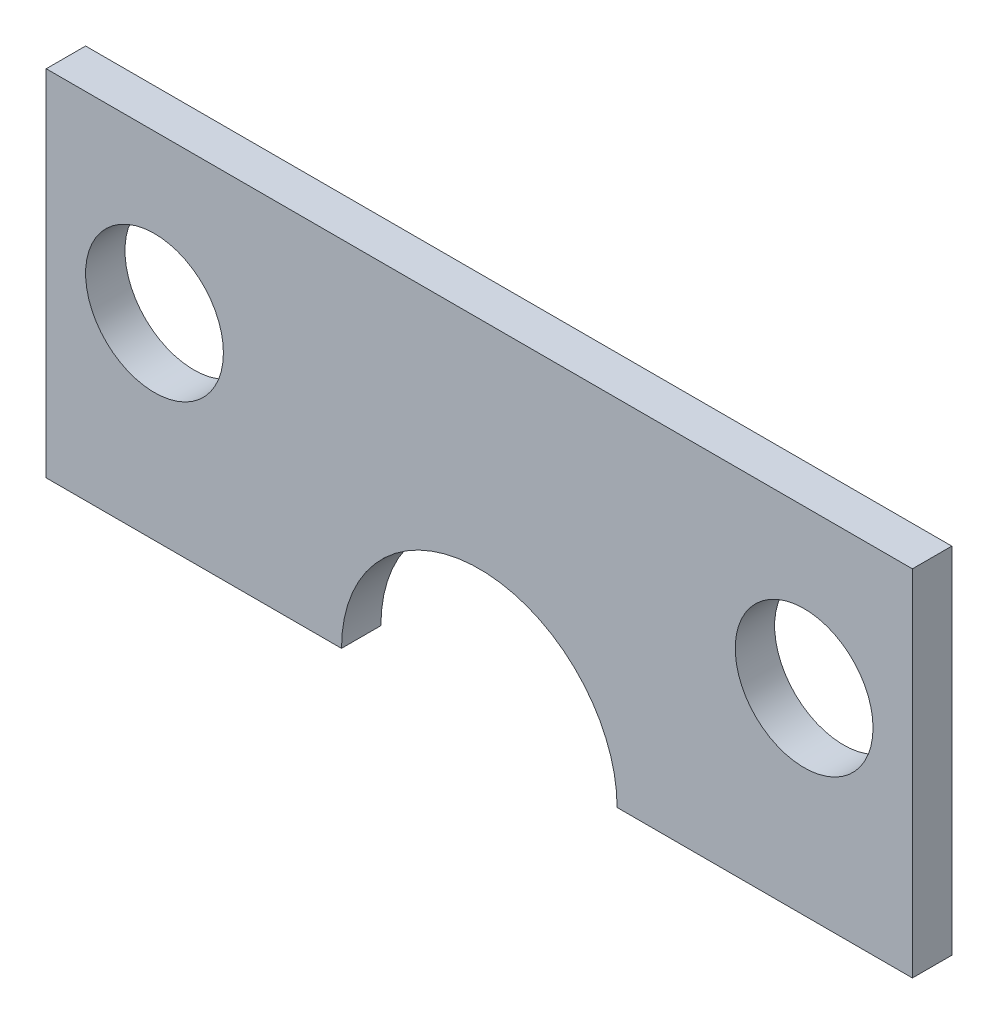
ISO-10303-21;
HEADER;
FILE_DESCRIPTION(('STEP AP214'),'2;1');
FILE_NAME('part.step','',(''),(''),'','','');
FILE_SCHEMA(('AUTOMOTIVE_DESIGN { 1 0 10303 214 1 1 1 1 }'));
ENDSEC;
DATA;
#1=APPLICATION_CONTEXT('core data for automotive mechanical design processes');
#2=APPLICATION_PROTOCOL_DEFINITION('international standard','automotive_design',2000,#1);
#3=PRODUCT_CONTEXT('',#1,'mechanical');
#4=PRODUCT('Part','Part','',(#3));
#5=PRODUCT_RELATED_PRODUCT_CATEGORY('part','',(#4));
#6=PRODUCT_DEFINITION_FORMATION('','',#4);
#7=PRODUCT_DEFINITION_CONTEXT('part definition',#1,'design');
#8=PRODUCT_DEFINITION('design','',#6,#7);
#9=PRODUCT_DEFINITION_SHAPE('','',#8);
#10=(LENGTH_UNIT() NAMED_UNIT(*) SI_UNIT(.MILLI.,.METRE.));
#11=(NAMED_UNIT(*) PLANE_ANGLE_UNIT() SI_UNIT($,.RADIAN.));
#12=(NAMED_UNIT(*) SI_UNIT($,.STERADIAN.) SOLID_ANGLE_UNIT());
#13=UNCERTAINTY_MEASURE_WITH_UNIT(LENGTH_MEASURE(1.E-05),#10,'distance_accuracy_value','');
#14=(GEOMETRIC_REPRESENTATION_CONTEXT(3) GLOBAL_UNCERTAINTY_ASSIGNED_CONTEXT((#13)) GLOBAL_UNIT_ASSIGNED_CONTEXT((#10,
#11,#12)) REPRESENTATION_CONTEXT('',''));
#15=CARTESIAN_POINT('',(0.,0.,0.));
#16=DIRECTION('',(0.,0.,1.));
#17=DIRECTION('',(1.,0.,0.));
#18=AXIS2_PLACEMENT_3D('',#15,#16,#17);
#19=CARTESIAN_POINT('',(-74.2896589058543,-72.3467724894815,-2.));
#20=DIRECTION('',(0.,-1.,0.));
#21=DIRECTION('',(0.,0.,-1.));
#22=AXIS2_PLACEMENT_3D('',#19,#20,#21);
#23=PLANE('',#22);
#24=DIRECTION('',(1.,0.,0.));
#25=VECTOR('',#24,1.);
#26=CARTESIAN_POINT('',(-74.2896589058543,-72.3467724894815,-2.));
#27=LINE('',#26,#25);
#28=CARTESIAN_POINT('',(-74.2896589058543,-72.3467724894815,-2.));
#29=VERTEX_POINT('',#28);
#30=CARTESIAN_POINT('',(-59.2896589058543,-72.3467724894815,-2.));
#31=VERTEX_POINT('',#30);
#32=EDGE_CURVE('E103',#29,#31,#27,.T.);
#33=ORIENTED_EDGE('',*,*,#32,.T.);
#34=DIRECTION('',(0.,0.,-1.));
#35=VECTOR('',#34,1.);
#36=CARTESIAN_POINT('',(-59.2896589058543,-72.3467724894815,59.4768862668516));
#37=LINE('',#36,#35);
#38=CARTESIAN_POINT('',(-59.2896589058543,-72.3467724894815,0.));
#39=VERTEX_POINT('',#38);
#40=EDGE_CURVE('E93',#39,#31,#37,.T.);
#41=ORIENTED_EDGE('',*,*,#40,.F.);
#42=DIRECTION('',(1.,0.,0.));
#43=VECTOR('',#42,1.);
#44=CARTESIAN_POINT('',(-74.2896589058543,-72.3467724894815,0.));
#45=LINE('',#44,#43);
#46=CARTESIAN_POINT('',(-74.2896589058543,-72.3467724894815,0.));
#47=VERTEX_POINT('',#46);
#48=EDGE_CURVE('E122',#47,#39,#45,.T.);
#49=ORIENTED_EDGE('',*,*,#48,.F.);
#50=DIRECTION('',(0.,0.,1.));
#51=VECTOR('',#50,1.);
#52=CARTESIAN_POINT('',(-74.2896589058543,-72.3467724894815,-2.));
#53=LINE('',#52,#51);
#54=EDGE_CURVE('E83',#29,#47,#53,.T.);
#55=ORIENTED_EDGE('',*,*,#54,.F.);
#56=EDGE_LOOP('',(#33,#41,#49,#55));
#57=FACE_BOUND('',#56,.T.);
#58=ADVANCED_FACE('F33',(#57),#23,.T.);
#59=CARTESIAN_POINT('',(-45.2896589058543,-72.3467724894815,0.));
#60=VERTEX_POINT('',#59);
#61=CARTESIAN_POINT('',(-30.2896589058543,-72.3467724894815,0.));
#62=VERTEX_POINT('',#61);
#63=EDGE_CURVE('E121',#60,#62,#45,.T.);
#64=ORIENTED_EDGE('',*,*,#63,.F.);
#65=DIRECTION('',(0.,0.,-1.));
#66=VECTOR('',#65,1.);
#67=CARTESIAN_POINT('',(-45.2896589058543,-72.3467724894815,59.4768862668516));
#68=LINE('',#67,#66);
#69=CARTESIAN_POINT('',(-45.2896589058543,-72.3467724894815,-2.));
#70=VERTEX_POINT('',#69);
#71=EDGE_CURVE('E50',#60,#70,#68,.T.);
#72=ORIENTED_EDGE('',*,*,#71,.T.);
#73=CARTESIAN_POINT('',(-30.2896589058543,-72.3467724894815,-2.));
#74=VERTEX_POINT('',#73);
#75=EDGE_CURVE('E105',#70,#74,#27,.T.);
#76=ORIENTED_EDGE('',*,*,#75,.T.);
#77=DIRECTION('',(0.,0.,1.));
#78=VECTOR('',#77,1.);
#79=CARTESIAN_POINT('',(-30.2896589058543,-72.3467724894815,-2.));
#80=LINE('',#79,#78);
#81=EDGE_CURVE('E131',#74,#62,#80,.T.);
#82=ORIENTED_EDGE('',*,*,#81,.T.);
#83=EDGE_LOOP('',(#64,#72,#76,#82));
#84=FACE_BOUND('',#83,.T.);
#85=ADVANCED_FACE('F148',(#84),#23,.T.);
#86=CARTESIAN_POINT('',(0.,0.,0.));
#87=DIRECTION('',(0.,0.,1.));
#88=DIRECTION('',(1.,0.,0.));
#89=AXIS2_PLACEMENT_3D('',#86,#87,#88);
#90=PLANE('',#89);
#91=CARTESIAN_POINT('',(-35.7896589058543,-62.3467724894815,0.));
#92=DIRECTION('',(0.,0.,1.));
#93=DIRECTION('',(1.,0.,0.));
#94=AXIS2_PLACEMENT_3D('',#91,#92,#93);
#95=CIRCLE('',#94,3.5);
#96=CARTESIAN_POINT('',(-32.2896589058543,-62.3467724894815,0.));
#97=VERTEX_POINT('',#96);
#98=EDGE_CURVE('E143',#97,#97,#95,.T.);
#99=ORIENTED_EDGE('',*,*,#98,.F.);
#100=EDGE_LOOP('',(#99));
#101=FACE_BOUND('',#100,.T.);
#102=CARTESIAN_POINT('',(-68.7896589058543,-62.3467724894815,0.));
#103=DIRECTION('',(0.,0.,1.));
#104=DIRECTION('',(1.,0.,0.));
#105=AXIS2_PLACEMENT_3D('',#102,#103,#104);
#106=CIRCLE('',#105,3.50000000000001);
#107=CARTESIAN_POINT('',(-65.2896589058543,-62.3467724894815,0.));
#108=VERTEX_POINT('',#107);
#109=EDGE_CURVE('E135',#108,#108,#106,.T.);
#110=ORIENTED_EDGE('',*,*,#109,.F.);
#111=EDGE_LOOP('',(#110));
#112=FACE_BOUND('',#111,.T.);
#113=ORIENTED_EDGE('',*,*,#48,.T.);
#114=CARTESIAN_POINT('',(-52.2896589058543,-72.3467724894815,0.));
#115=DIRECTION('',(0.,0.,1.));
#116=DIRECTION('',(1.,0.,0.));
#117=AXIS2_PLACEMENT_3D('',#114,#115,#116);
#118=CIRCLE('',#117,7.);
#119=EDGE_CURVE('E97',#60,#39,#118,.T.);
#120=ORIENTED_EDGE('',*,*,#119,.F.);
#121=ORIENTED_EDGE('',*,*,#63,.T.);
#122=DIRECTION('',(0.,1.,0.));
#123=VECTOR('',#122,1.);
#124=CARTESIAN_POINT('',(-30.2896589058543,-54.3467724894815,0.));
#125=LINE('',#124,#123);
#126=CARTESIAN_POINT('',(-30.2896589058543,-54.3467724894815,0.));
#127=VERTEX_POINT('',#126);
#128=EDGE_CURVE('E124',#62,#127,#125,.T.);
#129=ORIENTED_EDGE('',*,*,#128,.T.);
#130=DIRECTION('',(-1.,0.,0.));
#131=VECTOR('',#130,1.);
#132=CARTESIAN_POINT('',(-74.2896589058543,-54.3467724894815,0.));
#133=LINE('',#132,#131);
#134=CARTESIAN_POINT('',(-74.2896589058543,-54.3467724894815,0.));
#135=VERTEX_POINT('',#134);
#136=EDGE_CURVE('E127',#127,#135,#133,.T.);
#137=ORIENTED_EDGE('',*,*,#136,.T.);
#138=DIRECTION('',(0.,-1.,0.));
#139=VECTOR('',#138,1.);
#140=CARTESIAN_POINT('',(-74.2896589058543,-54.3467724894815,0.));
#141=LINE('',#140,#139);
#142=EDGE_CURVE('E118',#135,#47,#141,.T.);
#143=ORIENTED_EDGE('',*,*,#142,.T.);
#144=EDGE_LOOP('',(#113,#120,#121,#129,#137,#143));
#145=FACE_BOUND('',#144,.T.);
#146=ADVANCED_FACE('F152',(#101,#112,#145),#90,.T.);
#147=CARTESIAN_POINT('',(-74.2896589058543,-54.3467724894815,-2.));
#148=DIRECTION('',(-1.,0.,0.));
#149=DIRECTION('',(0.,-1.,0.));
#150=AXIS2_PLACEMENT_3D('',#147,#148,#149);
#151=PLANE('',#150);
#152=ORIENTED_EDGE('',*,*,#142,.F.);
#153=DIRECTION('',(0.,0.,1.));
#154=VECTOR('',#153,1.);
#155=CARTESIAN_POINT('',(-74.2896589058543,-54.3467724894815,-2.));
#156=LINE('',#155,#154);
#157=CARTESIAN_POINT('',(-74.2896589058543,-54.3467724894815,-2.));
#158=VERTEX_POINT('',#157);
#159=EDGE_CURVE('E11',#158,#135,#156,.T.);
#160=ORIENTED_EDGE('',*,*,#159,.F.);
#161=DIRECTION('',(0.,-1.,0.));
#162=VECTOR('',#161,1.);
#163=CARTESIAN_POINT('',(-74.2896589058543,-54.3467724894815,-2.));
#164=LINE('',#163,#162);
#165=EDGE_CURVE('E113',#158,#29,#164,.T.);
#166=ORIENTED_EDGE('',*,*,#165,.T.);
#167=ORIENTED_EDGE('',*,*,#54,.T.);
#168=EDGE_LOOP('',(#152,#160,#166,#167));
#169=FACE_BOUND('',#168,.T.);
#170=ADVANCED_FACE('F35',(#169),#151,.T.);
#171=CARTESIAN_POINT('',(-74.2896589058543,-54.3467724894815,-2.));
#172=DIRECTION('',(0.,1.,0.));
#173=DIRECTION('',(0.,0.,1.));
#174=AXIS2_PLACEMENT_3D('',#171,#172,#173);
#175=PLANE('',#174);
#176=ORIENTED_EDGE('',*,*,#136,.F.);
#177=DIRECTION('',(0.,0.,1.));
#178=VECTOR('',#177,1.);
#179=CARTESIAN_POINT('',(-30.2896589058543,-54.3467724894815,-2.));
#180=LINE('',#179,#178);
#181=CARTESIAN_POINT('',(-30.2896589058543,-54.3467724894815,-2.));
#182=VERTEX_POINT('',#181);
#183=EDGE_CURVE('E42',#182,#127,#180,.T.);
#184=ORIENTED_EDGE('',*,*,#183,.F.);
#185=DIRECTION('',(-1.,0.,0.));
#186=VECTOR('',#185,1.);
#187=CARTESIAN_POINT('',(-74.2896589058543,-54.3467724894815,-2.));
#188=LINE('',#187,#186);
#189=EDGE_CURVE('E111',#182,#158,#188,.T.);
#190=ORIENTED_EDGE('',*,*,#189,.T.);
#191=ORIENTED_EDGE('',*,*,#159,.T.);
#192=EDGE_LOOP('',(#176,#184,#190,#191));
#193=FACE_BOUND('',#192,.T.);
#194=ADVANCED_FACE('F154',(#193),#175,.T.);
#195=CARTESIAN_POINT('',(-30.2896589058543,-54.3467724894815,-2.));
#196=DIRECTION('',(1.,0.,0.));
#197=DIRECTION('',(0.,1.,0.));
#198=AXIS2_PLACEMENT_3D('',#195,#196,#197);
#199=PLANE('',#198);
#200=ORIENTED_EDGE('',*,*,#128,.F.);
#201=ORIENTED_EDGE('',*,*,#81,.F.);
#202=DIRECTION('',(0.,1.,0.));
#203=VECTOR('',#202,1.);
#204=CARTESIAN_POINT('',(-30.2896589058543,-54.3467724894815,-2.));
#205=LINE('',#204,#203);
#206=EDGE_CURVE('E108',#74,#182,#205,.T.);
#207=ORIENTED_EDGE('',*,*,#206,.T.);
#208=ORIENTED_EDGE('',*,*,#183,.T.);
#209=EDGE_LOOP('',(#200,#201,#207,#208));
#210=FACE_BOUND('',#209,.T.);
#211=ADVANCED_FACE('F156',(#210),#199,.T.);
#212=CARTESIAN_POINT('',(0.,0.,-2.));
#213=DIRECTION('',(0.,0.,1.));
#214=DIRECTION('',(1.,0.,0.));
#215=AXIS2_PLACEMENT_3D('',#212,#213,#214);
#216=PLANE('',#215);
#217=CARTESIAN_POINT('',(-35.7896589058543,-62.3467724894815,-2.));
#218=DIRECTION('',(0.,0.,1.));
#219=DIRECTION('',(1.,0.,0.));
#220=AXIS2_PLACEMENT_3D('',#217,#218,#219);
#221=CIRCLE('',#220,3.5);
#222=CARTESIAN_POINT('',(-32.2896589058543,-62.3467724894815,-2.));
#223=VERTEX_POINT('',#222);
#224=EDGE_CURVE('E37',#223,#223,#221,.T.);
#225=ORIENTED_EDGE('',*,*,#224,.T.);
#226=EDGE_LOOP('',(#225));
#227=FACE_BOUND('',#226,.T.);
#228=CARTESIAN_POINT('',(-68.7896589058543,-62.3467724894815,-2.));
#229=DIRECTION('',(0.,0.,1.));
#230=DIRECTION('',(1.,0.,0.));
#231=AXIS2_PLACEMENT_3D('',#228,#229,#230);
#232=CIRCLE('',#231,3.50000000000001);
#233=CARTESIAN_POINT('',(-65.2896589058543,-62.3467724894815,-2.));
#234=VERTEX_POINT('',#233);
#235=EDGE_CURVE('E106',#234,#234,#232,.T.);
#236=ORIENTED_EDGE('',*,*,#235,.T.);
#237=EDGE_LOOP('',(#236));
#238=FACE_BOUND('',#237,.T.);
#239=ORIENTED_EDGE('',*,*,#75,.F.);
#240=CARTESIAN_POINT('',(-52.2896589058543,-72.3467724894815,-2.));
#241=DIRECTION('',(0.,0.,1.));
#242=DIRECTION('',(1.,0.,0.));
#243=AXIS2_PLACEMENT_3D('',#240,#241,#242);
#244=CIRCLE('',#243,7.);
#245=EDGE_CURVE('E96',#70,#31,#244,.T.);
#246=ORIENTED_EDGE('',*,*,#245,.T.);
#247=ORIENTED_EDGE('',*,*,#32,.F.);
#248=ORIENTED_EDGE('',*,*,#165,.F.);
#249=ORIENTED_EDGE('',*,*,#189,.F.);
#250=ORIENTED_EDGE('',*,*,#206,.F.);
#251=EDGE_LOOP('',(#239,#246,#247,#248,#249,#250));
#252=FACE_BOUND('',#251,.T.);
#253=ADVANCED_FACE('F102',(#227,#238,#252),#216,.F.);
#254=CARTESIAN_POINT('',(-52.2896589058543,-72.3467724894815,59.4768862668516));
#255=DIRECTION('',(0.,0.,-1.));
#256=DIRECTION('',(-1.,0.,0.));
#257=AXIS2_PLACEMENT_3D('',#254,#255,#256);
#258=CYLINDRICAL_SURFACE('',#257,7.);
#259=ORIENTED_EDGE('',*,*,#71,.F.);
#260=ORIENTED_EDGE('',*,*,#119,.T.);
#261=ORIENTED_EDGE('',*,*,#40,.T.);
#262=ORIENTED_EDGE('',*,*,#245,.F.);
#263=EDGE_LOOP('',(#259,#260,#261,#262));
#264=FACE_BOUND('',#263,.T.);
#265=ADVANCED_FACE('F95',(#264),#258,.F.);
#266=CARTESIAN_POINT('',(-68.7896589058543,-62.3467724894815,-2.8));
#267=DIRECTION('',(0.,0.,1.));
#268=DIRECTION('',(1.,0.,0.));
#269=AXIS2_PLACEMENT_3D('',#266,#267,#268);
#270=CYLINDRICAL_SURFACE('',#269,3.50000000000001);
#271=ORIENTED_EDGE('',*,*,#109,.T.);
#272=EDGE_LOOP('',(#271));
#273=FACE_BOUND('',#272,.T.);
#274=ORIENTED_EDGE('',*,*,#235,.F.);
#275=EDGE_LOOP('',(#274));
#276=FACE_BOUND('',#275,.T.);
#277=ADVANCED_FACE('F183',(#273,#276),#270,.F.);
#278=CARTESIAN_POINT('',(-35.7896589058543,-62.3467724894815,-2.8));
#279=DIRECTION('',(0.,0.,1.));
#280=DIRECTION('',(1.,0.,0.));
#281=AXIS2_PLACEMENT_3D('',#278,#279,#280);
#282=CYLINDRICAL_SURFACE('',#281,3.5);
#283=ORIENTED_EDGE('',*,*,#98,.T.);
#284=EDGE_LOOP('',(#283));
#285=FACE_BOUND('',#284,.T.);
#286=ORIENTED_EDGE('',*,*,#224,.F.);
#287=EDGE_LOOP('',(#286));
#288=FACE_BOUND('',#287,.T.);
#289=ADVANCED_FACE('F186',(#285,#288),#282,.F.);
#290=CLOSED_SHELL('',(#58,#85,#146,#170,#194,#211,#253,#265,#277,#289));
#291=MANIFOLD_SOLID_BREP('B2',#290);
#292=ADVANCED_BREP_SHAPE_REPRESENTATION('',(#18,#291),#14);
#293=SHAPE_DEFINITION_REPRESENTATION(#9,#292);
ENDSEC;
END-ISO-10303-21;
